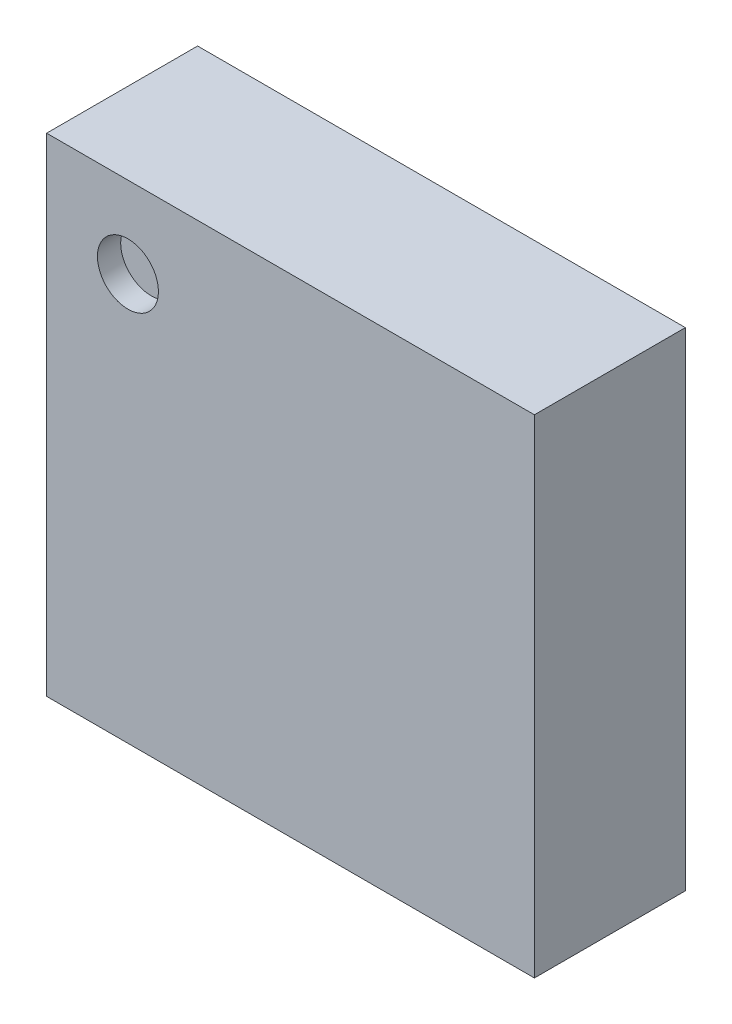
ISO-10303-21;
HEADER;
FILE_DESCRIPTION(('STEP AP214'),'2;1');
FILE_NAME('part.step','',(''),(''),'','','');
FILE_SCHEMA(('AUTOMOTIVE_DESIGN { 1 0 10303 214 1 1 1 1 }'));
ENDSEC;
DATA;
#1=APPLICATION_CONTEXT('core data for automotive mechanical design processes');
#2=APPLICATION_PROTOCOL_DEFINITION('international standard','automotive_design',2000,#1);
#3=PRODUCT_CONTEXT('',#1,'mechanical');
#4=PRODUCT('Part','Part','',(#3));
#5=PRODUCT_RELATED_PRODUCT_CATEGORY('part','',(#4));
#6=PRODUCT_DEFINITION_FORMATION('','',#4);
#7=PRODUCT_DEFINITION_CONTEXT('part definition',#1,'design');
#8=PRODUCT_DEFINITION('design','',#6,#7);
#9=PRODUCT_DEFINITION_SHAPE('','',#8);
#10=(LENGTH_UNIT() NAMED_UNIT(*) SI_UNIT(.MILLI.,.METRE.));
#11=(NAMED_UNIT(*) PLANE_ANGLE_UNIT() SI_UNIT($,.RADIAN.));
#12=(NAMED_UNIT(*) SI_UNIT($,.STERADIAN.) SOLID_ANGLE_UNIT());
#13=UNCERTAINTY_MEASURE_WITH_UNIT(LENGTH_MEASURE(1.E-05),#10,'distance_accuracy_value','');
#14=(GEOMETRIC_REPRESENTATION_CONTEXT(3) GLOBAL_UNCERTAINTY_ASSIGNED_CONTEXT((#13)) GLOBAL_UNIT_ASSIGNED_CONTEXT((#10,
#11,#12)) REPRESENTATION_CONTEXT('',''));
#15=CARTESIAN_POINT('',(0.,0.,0.));
#16=DIRECTION('',(0.,0.,1.));
#17=DIRECTION('',(1.,0.,0.));
#18=AXIS2_PLACEMENT_3D('',#15,#16,#17);
#19=CARTESIAN_POINT('',(0.35,1.75,0.55));
#20=DIRECTION('',(0.,0.,1.));
#21=DIRECTION('',(1.,0.,0.));
#22=AXIS2_PLACEMENT_3D('',#19,#20,#21);
#23=PLANE('',#22);
#24=CARTESIAN_POINT('',(0.35,1.75,0.55));
#25=DIRECTION('',(0.,0.,1.));
#26=DIRECTION('',(1.,0.,0.));
#27=AXIS2_PLACEMENT_3D('',#24,#25,#26);
#28=CIRCLE('',#27,0.13125);
#29=CARTESIAN_POINT('',(0.21875,1.75,0.55));
#30=VERTEX_POINT('',#29);
#31=EDGE_CURVE('E27',#30,#30,#28,.T.);
#32=ORIENTED_EDGE('',*,*,#31,.T.);
#33=EDGE_LOOP('',(#32));
#34=FACE_BOUND('',#33,.T.);
#35=ADVANCED_FACE('F16',(#34),#23,.T.);
#36=CARTESIAN_POINT('',(0.35,1.75,0.55));
#37=DIRECTION('',(0.,0.,1.));
#38=DIRECTION('',(1.,0.,0.));
#39=AXIS2_PLACEMENT_3D('',#36,#37,#38);
#40=CYLINDRICAL_SURFACE('',#39,0.13125);
#41=ORIENTED_EDGE('',*,*,#31,.F.);
#42=DIRECTION('',(0.,0.,1.));
#43=VECTOR('',#42,1.);
#44=CARTESIAN_POINT('',(0.21875,1.75,0.55));
#45=LINE('',#44,#43);
#46=CARTESIAN_POINT('',(0.21875,1.75,0.65));
#47=VERTEX_POINT('',#46);
#48=EDGE_CURVE('E11',#30,#47,#45,.T.);
#49=ORIENTED_EDGE('',*,*,#48,.T.);
#50=CARTESIAN_POINT('',(0.35,1.75,0.65));
#51=DIRECTION('',(0.,0.,1.));
#52=DIRECTION('',(1.,0.,0.));
#53=AXIS2_PLACEMENT_3D('',#50,#51,#52);
#54=CIRCLE('',#53,0.13125);
#55=EDGE_CURVE('E99',#47,#47,#54,.T.);
#56=ORIENTED_EDGE('',*,*,#55,.T.);
#57=ORIENTED_EDGE('',*,*,#48,.F.);
#58=EDGE_LOOP('',(#41,#49,#56,#57));
#59=FACE_BOUND('',#58,.T.);
#60=ADVANCED_FACE('F241',(#59),#40,.F.);
#61=CARTESIAN_POINT('',(2.1,0.,0.));
#62=DIRECTION('',(1.,0.,0.));
#63=DIRECTION('',(0.,1.,0.));
#64=AXIS2_PLACEMENT_3D('',#61,#62,#63);
#65=PLANE('',#64);
#66=DIRECTION('',(0.,0.,1.));
#67=VECTOR('',#66,1.);
#68=CARTESIAN_POINT('',(2.1,0.,0.));
#69=LINE('',#68,#67);
#70=CARTESIAN_POINT('',(2.1,0.,0.));
#71=VERTEX_POINT('',#70);
#72=CARTESIAN_POINT('',(2.1,0.,0.65));
#73=VERTEX_POINT('',#72);
#74=EDGE_CURVE('E132',#71,#73,#69,.T.);
#75=ORIENTED_EDGE('',*,*,#74,.F.);
#76=DIRECTION('',(0.,1.,0.));
#77=VECTOR('',#76,1.);
#78=CARTESIAN_POINT('',(2.1,0.,0.));
#79=LINE('',#78,#77);
#80=CARTESIAN_POINT('',(2.1,2.1,0.));
#81=VERTEX_POINT('',#80);
#82=EDGE_CURVE('E82',#71,#81,#79,.T.);
#83=ORIENTED_EDGE('',*,*,#82,.T.);
#84=DIRECTION('',(0.,0.,1.));
#85=VECTOR('',#84,1.);
#86=CARTESIAN_POINT('',(2.1,2.1,0.));
#87=LINE('',#86,#85);
#88=CARTESIAN_POINT('',(2.1,2.1,0.65));
#89=VERTEX_POINT('',#88);
#90=EDGE_CURVE('E97',#81,#89,#87,.T.);
#91=ORIENTED_EDGE('',*,*,#90,.T.);
#92=DIRECTION('',(0.,1.,0.));
#93=VECTOR('',#92,1.);
#94=CARTESIAN_POINT('',(2.1,0.,0.65));
#95=LINE('',#94,#93);
#96=EDGE_CURVE('E122',#73,#89,#95,.T.);
#97=ORIENTED_EDGE('',*,*,#96,.F.);
#98=EDGE_LOOP('',(#75,#83,#91,#97));
#99=FACE_BOUND('',#98,.T.);
#100=ADVANCED_FACE('F147',(#99),#65,.T.);
#101=CARTESIAN_POINT('',(0.,0.,0.));
#102=DIRECTION('',(0.,0.,1.));
#103=DIRECTION('',(1.,0.,0.));
#104=AXIS2_PLACEMENT_3D('',#101,#102,#103);
#105=PLANE('',#104);
#106=DIRECTION('',(0.,1.,0.));
#107=VECTOR('',#106,1.);
#108=CARTESIAN_POINT('',(0.,0.,0.));
#109=LINE('',#108,#107);
#110=CARTESIAN_POINT('',(0.,0.,0.));
#111=VERTEX_POINT('',#110);
#112=CARTESIAN_POINT('',(0.,2.1,0.));
#113=VERTEX_POINT('',#112);
#114=EDGE_CURVE('E101',#111,#113,#109,.T.);
#115=ORIENTED_EDGE('',*,*,#114,.T.);
#116=DIRECTION('',(1.,0.,0.));
#117=VECTOR('',#116,1.);
#118=CARTESIAN_POINT('',(0.,2.1,0.));
#119=LINE('',#118,#117);
#120=EDGE_CURVE('E91',#113,#81,#119,.T.);
#121=ORIENTED_EDGE('',*,*,#120,.T.);
#122=ORIENTED_EDGE('',*,*,#82,.F.);
#123=DIRECTION('',(1.,0.,0.));
#124=VECTOR('',#123,1.);
#125=CARTESIAN_POINT('',(0.,0.,0.));
#126=LINE('',#125,#124);
#127=EDGE_CURVE('E75',#111,#71,#126,.T.);
#128=ORIENTED_EDGE('',*,*,#127,.F.);
#129=EDGE_LOOP('',(#115,#121,#122,#128));
#130=FACE_BOUND('',#129,.T.);
#131=ADVANCED_FACE('F18',(#130),#105,.F.);
#132=CARTESIAN_POINT('',(0.,2.1,0.));
#133=DIRECTION('',(0.,1.,0.));
#134=DIRECTION('',(1.,0.,0.));
#135=AXIS2_PLACEMENT_3D('',#132,#133,#134);
#136=PLANE('',#135);
#137=ORIENTED_EDGE('',*,*,#120,.F.);
#138=DIRECTION('',(0.,0.,1.));
#139=VECTOR('',#138,1.);
#140=CARTESIAN_POINT('',(0.,2.1,0.));
#141=LINE('',#140,#139);
#142=CARTESIAN_POINT('',(0.,2.1,0.65));
#143=VERTEX_POINT('',#142);
#144=EDGE_CURVE('E95',#113,#143,#141,.T.);
#145=ORIENTED_EDGE('',*,*,#144,.T.);
#146=DIRECTION('',(1.,0.,0.));
#147=VECTOR('',#146,1.);
#148=CARTESIAN_POINT('',(0.,2.1,0.65));
#149=LINE('',#148,#147);
#150=EDGE_CURVE('E20',#143,#89,#149,.T.);
#151=ORIENTED_EDGE('',*,*,#150,.T.);
#152=ORIENTED_EDGE('',*,*,#90,.F.);
#153=EDGE_LOOP('',(#137,#145,#151,#152));
#154=FACE_BOUND('',#153,.T.);
#155=ADVANCED_FACE('F92',(#154),#136,.T.);
#156=CARTESIAN_POINT('',(0.,0.,0.65));
#157=DIRECTION('',(0.,0.,1.));
#158=DIRECTION('',(1.,0.,0.));
#159=AXIS2_PLACEMENT_3D('',#156,#157,#158);
#160=PLANE('',#159);
#161=ORIENTED_EDGE('',*,*,#55,.F.);
#162=EDGE_LOOP('',(#161));
#163=FACE_BOUND('',#162,.T.);
#164=DIRECTION('',(0.,1.,0.));
#165=VECTOR('',#164,1.);
#166=CARTESIAN_POINT('',(0.,0.,0.65));
#167=LINE('',#166,#165);
#168=CARTESIAN_POINT('',(0.,0.,0.65));
#169=VERTEX_POINT('',#168);
#170=EDGE_CURVE('E107',#169,#143,#167,.T.);
#171=ORIENTED_EDGE('',*,*,#170,.F.);
#172=DIRECTION('',(1.,0.,0.));
#173=VECTOR('',#172,1.);
#174=CARTESIAN_POINT('',(0.,0.,0.65));
#175=LINE('',#174,#173);
#176=EDGE_CURVE('E62',#169,#73,#175,.T.);
#177=ORIENTED_EDGE('',*,*,#176,.T.);
#178=ORIENTED_EDGE('',*,*,#96,.T.);
#179=ORIENTED_EDGE('',*,*,#150,.F.);
#180=EDGE_LOOP('',(#171,#177,#178,#179));
#181=FACE_BOUND('',#180,.T.);
#182=ADVANCED_FACE('F202',(#163,#181),#160,.T.);
#183=CARTESIAN_POINT('',(0.,0.,0.));
#184=DIRECTION('',(0.,1.,0.));
#185=DIRECTION('',(1.,0.,0.));
#186=AXIS2_PLACEMENT_3D('',#183,#184,#185);
#187=PLANE('',#186);
#188=ORIENTED_EDGE('',*,*,#127,.T.);
#189=ORIENTED_EDGE('',*,*,#74,.T.);
#190=ORIENTED_EDGE('',*,*,#176,.F.);
#191=DIRECTION('',(0.,0.,1.));
#192=VECTOR('',#191,1.);
#193=CARTESIAN_POINT('',(0.,0.,0.));
#194=LINE('',#193,#192);
#195=EDGE_CURVE('E114',#111,#169,#194,.T.);
#196=ORIENTED_EDGE('',*,*,#195,.F.);
#197=EDGE_LOOP('',(#188,#189,#190,#196));
#198=FACE_BOUND('',#197,.T.);
#199=ADVANCED_FACE('F148',(#198),#187,.F.);
#200=CARTESIAN_POINT('',(0.,0.,0.));
#201=DIRECTION('',(1.,0.,0.));
#202=DIRECTION('',(0.,1.,0.));
#203=AXIS2_PLACEMENT_3D('',#200,#201,#202);
#204=PLANE('',#203);
#205=ORIENTED_EDGE('',*,*,#195,.T.);
#206=ORIENTED_EDGE('',*,*,#170,.T.);
#207=ORIENTED_EDGE('',*,*,#144,.F.);
#208=ORIENTED_EDGE('',*,*,#114,.F.);
#209=EDGE_LOOP('',(#205,#206,#207,#208));
#210=FACE_BOUND('',#209,.T.);
#211=ADVANCED_FACE('F106',(#210),#204,.F.);
#212=CLOSED_SHELL('',(#35,#60,#100,#131,#155,#182,#199,#211));
#213=MANIFOLD_SOLID_BREP('B1',#212);
#214=ADVANCED_BREP_SHAPE_REPRESENTATION('',(#18,#213),#14);
#215=SHAPE_DEFINITION_REPRESENTATION(#9,#214);
ENDSEC;
END-ISO-10303-21;
